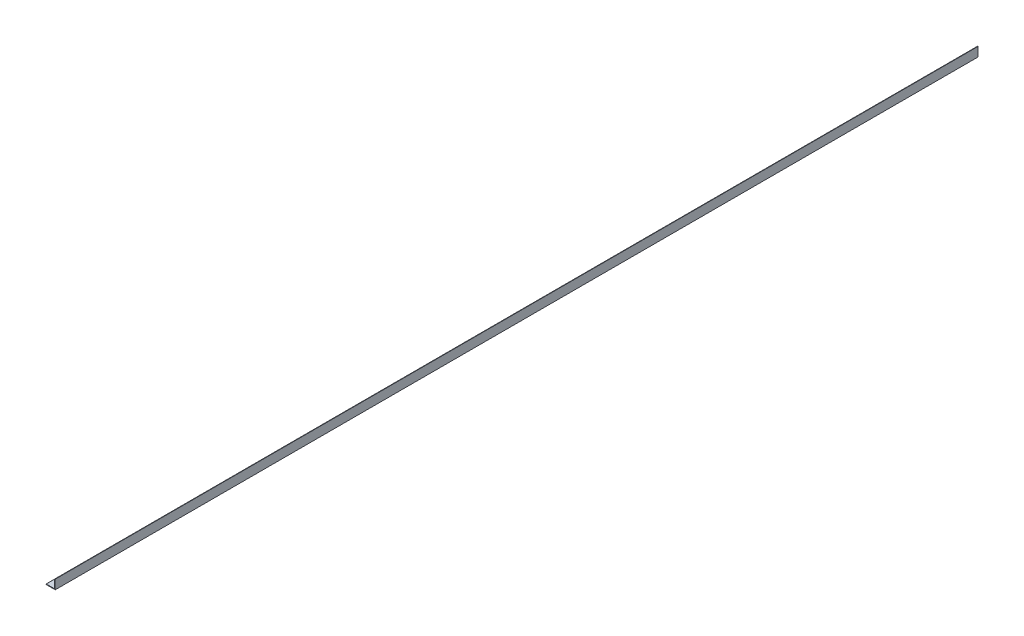
ISO-10303-21;
HEADER;
FILE_DESCRIPTION(('STEP AP214'),'2;1');
FILE_NAME('part.step','',(''),(''),'','','');
FILE_SCHEMA(('AUTOMOTIVE_DESIGN { 1 0 10303 214 1 1 1 1 }'));
ENDSEC;
DATA;
#1=APPLICATION_CONTEXT('core data for automotive mechanical design processes');
#2=APPLICATION_PROTOCOL_DEFINITION('international standard','automotive_design',2000,#1);
#3=PRODUCT_CONTEXT('',#1,'mechanical');
#4=PRODUCT('Part','Part','',(#3));
#5=PRODUCT_RELATED_PRODUCT_CATEGORY('part','',(#4));
#6=PRODUCT_DEFINITION_FORMATION('','',#4);
#7=PRODUCT_DEFINITION_CONTEXT('part definition',#1,'design');
#8=PRODUCT_DEFINITION('design','',#6,#7);
#9=PRODUCT_DEFINITION_SHAPE('','',#8);
#10=(LENGTH_UNIT() NAMED_UNIT(*) SI_UNIT(.MILLI.,.METRE.));
#11=(NAMED_UNIT(*) PLANE_ANGLE_UNIT() SI_UNIT($,.RADIAN.));
#12=(NAMED_UNIT(*) SI_UNIT($,.STERADIAN.) SOLID_ANGLE_UNIT());
#13=UNCERTAINTY_MEASURE_WITH_UNIT(LENGTH_MEASURE(1.E-05),#10,'distance_accuracy_value','');
#14=(GEOMETRIC_REPRESENTATION_CONTEXT(3) GLOBAL_UNCERTAINTY_ASSIGNED_CONTEXT((#13)) GLOBAL_UNIT_ASSIGNED_CONTEXT((#10,
#11,#12)) REPRESENTATION_CONTEXT('',''));
#15=CARTESIAN_POINT('',(0.,0.,0.));
#16=DIRECTION('',(0.,0.,1.));
#17=DIRECTION('',(1.,0.,0.));
#18=AXIS2_PLACEMENT_3D('',#15,#16,#17);
#19=CARTESIAN_POINT('',(9.5377,-11.1125,1270.));
#20=DIRECTION('',(0.,-1.,0.));
#21=DIRECTION('',(0.,0.,-1.));
#22=AXIS2_PLACEMENT_3D('',#19,#20,#21);
#23=PLANE('',#22);
#24=DIRECTION('',(0.,0.,1.));
#25=VECTOR('',#24,1.);
#26=CARTESIAN_POINT('',(-4.6355,-11.1125,1057.275));
#27=LINE('',#26,#25);
#28=CARTESIAN_POINT('',(-4.6355,-11.1125,1057.275));
#29=VERTEX_POINT('',#28);
#30=CARTESIAN_POINT('',(-4.63549999999999,-11.1125,1076.325));
#31=VERTEX_POINT('',#30);
#32=EDGE_CURVE('E249',#29,#31,#27,.T.);
#33=ORIENTED_EDGE('',*,*,#32,.F.);
#34=CARTESIAN_POINT('',(-1.5875,-11.1125,1057.275));
#35=DIRECTION('',(0.,1.,0.));
#36=DIRECTION('',(0.,0.,1.));
#37=AXIS2_PLACEMENT_3D('',#34,#35,#36);
#38=CIRCLE('',#37,3.048);
#39=CARTESIAN_POINT('',(1.4605,-11.1125,1057.275));
#40=VERTEX_POINT('',#39);
#41=EDGE_CURVE('E60',#40,#29,#38,.T.);
#42=ORIENTED_EDGE('',*,*,#41,.F.);
#43=DIRECTION('',(0.,0.,-1.));
#44=VECTOR('',#43,1.);
#45=CARTESIAN_POINT('',(1.4605,-11.1125,1057.275));
#46=LINE('',#45,#44);
#47=CARTESIAN_POINT('',(1.4605,-11.1125,1076.325));
#48=VERTEX_POINT('',#47);
#49=EDGE_CURVE('E236',#48,#40,#46,.T.);
#50=ORIENTED_EDGE('',*,*,#49,.F.);
#51=CARTESIAN_POINT('',(-1.58749999999999,-11.1125,1076.325));
#52=DIRECTION('',(0.,1.,0.));
#53=DIRECTION('',(0.,0.,1.));
#54=AXIS2_PLACEMENT_3D('',#51,#52,#53);
#55=CIRCLE('',#54,3.048);
#56=EDGE_CURVE('E240',#31,#48,#55,.T.);
#57=ORIENTED_EDGE('',*,*,#56,.F.);
#58=EDGE_LOOP('',(#33,#42,#50,#57));
#59=FACE_BOUND('',#58,.T.);
#60=DIRECTION('',(0.,0.,1.));
#61=VECTOR('',#60,1.);
#62=CARTESIAN_POINT('',(-4.63550000000005,-11.1125,641.35));
#63=LINE('',#62,#61);
#64=CARTESIAN_POINT('',(-4.63550000000005,-11.1125,641.35));
#65=VERTEX_POINT('',#64);
#66=CARTESIAN_POINT('',(-4.63550000000004,-11.1125,660.4));
#67=VERTEX_POINT('',#66);
#68=EDGE_CURVE('E285',#65,#67,#63,.T.);
#69=ORIENTED_EDGE('',*,*,#68,.F.);
#70=CARTESIAN_POINT('',(-1.58750000000005,-11.1125,641.35));
#71=DIRECTION('',(0.,1.,0.));
#72=DIRECTION('',(0.,0.,1.));
#73=AXIS2_PLACEMENT_3D('',#70,#71,#72);
#74=CIRCLE('',#73,3.048);
#75=CARTESIAN_POINT('',(1.46049999999995,-11.1125,641.35));
#76=VERTEX_POINT('',#75);
#77=EDGE_CURVE('E68',#76,#65,#74,.T.);
#78=ORIENTED_EDGE('',*,*,#77,.F.);
#79=DIRECTION('',(0.,0.,-1.));
#80=VECTOR('',#79,1.);
#81=CARTESIAN_POINT('',(1.46049999999995,-11.1125,641.35));
#82=LINE('',#81,#80);
#83=CARTESIAN_POINT('',(1.46049999999996,-11.1125,660.4));
#84=VERTEX_POINT('',#83);
#85=EDGE_CURVE('E270',#84,#76,#82,.T.);
#86=ORIENTED_EDGE('',*,*,#85,.F.);
#87=CARTESIAN_POINT('',(-1.58750000000004,-11.1125,660.4));
#88=DIRECTION('',(0.,1.,0.));
#89=DIRECTION('',(0.,0.,1.));
#90=AXIS2_PLACEMENT_3D('',#87,#88,#89);
#91=CIRCLE('',#90,3.048);
#92=EDGE_CURVE('E290',#67,#84,#91,.T.);
#93=ORIENTED_EDGE('',*,*,#92,.F.);
#94=EDGE_LOOP('',(#69,#78,#86,#93));
#95=FACE_BOUND('',#94,.T.);
#96=DIRECTION('',(0.,0.,-1.));
#97=VECTOR('',#96,1.);
#98=CARTESIAN_POINT('',(1.46049999999992,-11.1125,-317.5));
#99=LINE('',#98,#97);
#100=CARTESIAN_POINT('',(1.46049999999992,-11.1125,-317.5));
#101=VERTEX_POINT('',#100);
#102=CARTESIAN_POINT('',(1.46049999999992,-11.1125,-336.55));
#103=VERTEX_POINT('',#102);
#104=EDGE_CURVE('E328',#101,#103,#99,.T.);
#105=ORIENTED_EDGE('',*,*,#104,.F.);
#106=CARTESIAN_POINT('',(-1.58750000000008,-11.1125,-317.5));
#107=DIRECTION('',(0.,1.,0.));
#108=DIRECTION('',(0.,0.,-1.));
#109=AXIS2_PLACEMENT_3D('',#106,#107,#108);
#110=CIRCLE('',#109,3.048);
#111=CARTESIAN_POINT('',(-4.63550000000008,-11.1125,-317.5));
#112=VERTEX_POINT('',#111);
#113=EDGE_CURVE('E325',#112,#101,#110,.T.);
#114=ORIENTED_EDGE('',*,*,#113,.F.);
#115=DIRECTION('',(0.,0.,1.));
#116=VECTOR('',#115,1.);
#117=CARTESIAN_POINT('',(-4.63550000000008,-11.1125,-317.5));
#118=LINE('',#117,#116);
#119=CARTESIAN_POINT('',(-4.63550000000008,-11.1125,-336.55));
#120=VERTEX_POINT('',#119);
#121=EDGE_CURVE('E312',#120,#112,#118,.T.);
#122=ORIENTED_EDGE('',*,*,#121,.F.);
#123=CARTESIAN_POINT('',(-1.58750000000008,-11.1125,-336.55));
#124=DIRECTION('',(0.,1.,0.));
#125=DIRECTION('',(0.,0.,-1.));
#126=AXIS2_PLACEMENT_3D('',#123,#124,#125);
#127=CIRCLE('',#126,3.048);
#128=EDGE_CURVE('E333',#103,#120,#127,.T.);
#129=ORIENTED_EDGE('',*,*,#128,.F.);
#130=EDGE_LOOP('',(#105,#114,#122,#129));
#131=FACE_BOUND('',#130,.T.);
#132=DIRECTION('',(0.,0.,-1.));
#133=VECTOR('',#132,1.);
#134=CARTESIAN_POINT('',(1.46049999999998,-11.1125,-717.55));
#135=LINE('',#134,#133);
#136=CARTESIAN_POINT('',(1.46049999999998,-11.1125,-717.55));
#137=VERTEX_POINT('',#136);
#138=CARTESIAN_POINT('',(1.46049999999999,-11.1125,-1092.2));
#139=VERTEX_POINT('',#138);
#140=EDGE_CURVE('E372',#137,#139,#135,.T.);
#141=ORIENTED_EDGE('',*,*,#140,.F.);
#142=CARTESIAN_POINT('',(-1.58750000000002,-11.1125,-717.55));
#143=DIRECTION('',(0.,1.,0.));
#144=DIRECTION('',(0.,0.,-1.));
#145=AXIS2_PLACEMENT_3D('',#142,#143,#144);
#146=CIRCLE('',#145,3.048);
#147=CARTESIAN_POINT('',(-4.63550000000002,-11.1125,-717.55));
#148=VERTEX_POINT('',#147);
#149=EDGE_CURVE('E369',#148,#137,#146,.T.);
#150=ORIENTED_EDGE('',*,*,#149,.F.);
#151=DIRECTION('',(0.,0.,1.));
#152=VECTOR('',#151,1.);
#153=CARTESIAN_POINT('',(-4.63550000000002,-11.1125,-717.55));
#154=LINE('',#153,#152);
#155=CARTESIAN_POINT('',(-4.63550000000001,-11.1125,-1092.2));
#156=VERTEX_POINT('',#155);
#157=EDGE_CURVE('E356',#156,#148,#154,.T.);
#158=ORIENTED_EDGE('',*,*,#157,.F.);
#159=CARTESIAN_POINT('',(-1.58750000000001,-11.1125,-1092.2));
#160=DIRECTION('',(0.,1.,0.));
#161=DIRECTION('',(0.,0.,-1.));
#162=AXIS2_PLACEMENT_3D('',#159,#160,#161);
#163=CIRCLE('',#162,3.048);
#164=EDGE_CURVE('E376',#139,#156,#163,.T.);
#165=ORIENTED_EDGE('',*,*,#164,.F.);
#166=EDGE_LOOP('',(#141,#150,#158,#165));
#167=FACE_BOUND('',#166,.T.);
#168=CARTESIAN_POINT('',(-1.5875,-11.1125,1017.524));
#169=DIRECTION('',(0.,1.,0.));
#170=DIRECTION('',(0.,0.,1.));
#171=AXIS2_PLACEMENT_3D('',#168,#169,#170);
#172=CIRCLE('',#171,2.55269999999999);
#173=CARTESIAN_POINT('',(-1.5875,-11.1125,1020.0767));
#174=VERTEX_POINT('',#173);
#175=EDGE_CURVE('E259',#174,#174,#172,.T.);
#176=ORIENTED_EDGE('',*,*,#175,.F.);
#177=EDGE_LOOP('',(#176));
#178=FACE_BOUND('',#177,.T.);
#179=CARTESIAN_POINT('',(-1.5875,-11.1125,-349.504));
#180=DIRECTION('',(0.,1.,0.));
#181=DIRECTION('',(0.,0.,1.));
#182=AXIS2_PLACEMENT_3D('',#179,#180,#181);
#183=CIRCLE('',#182,2.55269999999999);
#184=CARTESIAN_POINT('',(-1.5875,-11.1125,-346.9513));
#185=VERTEX_POINT('',#184);
#186=EDGE_CURVE('E409',#185,#185,#183,.T.);
#187=ORIENTED_EDGE('',*,*,#186,.F.);
#188=EDGE_LOOP('',(#187));
#189=FACE_BOUND('',#188,.T.);
#190=CARTESIAN_POINT('',(-1.5875,-11.1125,106.172));
#191=DIRECTION('',(0.,1.,0.));
#192=DIRECTION('',(0.,0.,1.));
#193=AXIS2_PLACEMENT_3D('',#190,#191,#192);
#194=CIRCLE('',#193,2.55269999999999);
#195=CARTESIAN_POINT('',(-1.5875,-11.1125,108.7247));
#196=VERTEX_POINT('',#195);
#197=EDGE_CURVE('E417',#196,#196,#194,.T.);
#198=ORIENTED_EDGE('',*,*,#197,.F.);
#199=EDGE_LOOP('',(#198));
#200=FACE_BOUND('',#199,.T.);
#201=DIRECTION('',(-1.,0.,0.));
#202=VECTOR('',#201,1.);
#203=CARTESIAN_POINT('',(9.5377,-11.1125,-1270.));
#204=LINE('',#203,#202);
#205=CARTESIAN_POINT('',(9.5377,-11.1125,-1270.));
#206=VERTEX_POINT('',#205);
#207=CARTESIAN_POINT('',(-11.90625,-11.1125,-1270.));
#208=VERTEX_POINT('',#207);
#209=EDGE_CURVE('E477',#206,#208,#204,.T.);
#210=ORIENTED_EDGE('',*,*,#209,.T.);
#211=DIRECTION('',(0.,0.,-1.));
#212=VECTOR('',#211,1.);
#213=CARTESIAN_POINT('',(-11.90625,-11.1125,1270.));
#214=LINE('',#213,#212);
#215=CARTESIAN_POINT('',(-11.90625,-11.1125,1270.));
#216=VERTEX_POINT('',#215);
#217=EDGE_CURVE('E485',#216,#208,#214,.T.);
#218=ORIENTED_EDGE('',*,*,#217,.F.);
#219=DIRECTION('',(-1.,0.,0.));
#220=VECTOR('',#219,1.);
#221=CARTESIAN_POINT('',(9.5377,-11.1125,1270.));
#222=LINE('',#221,#220);
#223=CARTESIAN_POINT('',(9.5377,-11.1125,1270.));
#224=VERTEX_POINT('',#223);
#225=EDGE_CURVE('E449',#224,#216,#222,.T.);
#226=ORIENTED_EDGE('',*,*,#225,.F.);
#227=DIRECTION('',(0.,0.,-1.));
#228=VECTOR('',#227,1.);
#229=CARTESIAN_POINT('',(9.5377,-11.1125,1270.));
#230=LINE('',#229,#228);
#231=EDGE_CURVE('E489',#224,#206,#230,.T.);
#232=ORIENTED_EDGE('',*,*,#231,.T.);
#233=EDGE_LOOP('',(#210,#218,#226,#232));
#234=FACE_BOUND('',#233,.T.);
#235=CARTESIAN_POINT('',(-1.5875,-11.1125,561.848));
#236=DIRECTION('',(0.,1.,0.));
#237=DIRECTION('',(0.,0.,1.));
#238=AXIS2_PLACEMENT_3D('',#235,#236,#237);
#239=CIRCLE('',#238,2.55269999999999);
#240=CARTESIAN_POINT('',(-1.5875,-11.1125,564.4007));
#241=VERTEX_POINT('',#240);
#242=EDGE_CURVE('E401',#241,#241,#239,.T.);
#243=ORIENTED_EDGE('',*,*,#242,.F.);
#244=EDGE_LOOP('',(#243));
#245=FACE_BOUND('',#244,.T.);
#246=ADVANCED_FACE('F44',(#59,#95,#131,#167,#178,#189,#200,#234,#245),#23,.F.);
#247=CARTESIAN_POINT('',(-12.7,-11.90625,1270.));
#248=DIRECTION('',(1.,0.,0.));
#249=DIRECTION('',(0.,0.,-1.));
#250=AXIS2_PLACEMENT_3D('',#247,#248,#249);
#251=PLANE('',#250);
#252=DIRECTION('',(0.,-1.,0.));
#253=VECTOR('',#252,1.);
#254=CARTESIAN_POINT('',(-12.7,-11.90625,-1270.));
#255=LINE('',#254,#253);
#256=CARTESIAN_POINT('',(-12.7,-11.90625,-1270.));
#257=VERTEX_POINT('',#256);
#258=CARTESIAN_POINT('',(-12.7,-12.7,-1270.));
#259=VERTEX_POINT('',#258);
#260=EDGE_CURVE('E425',#257,#259,#255,.T.);
#261=ORIENTED_EDGE('',*,*,#260,.T.);
#262=DIRECTION('',(0.,0.,-1.));
#263=VECTOR('',#262,1.);
#264=CARTESIAN_POINT('',(-12.7,-12.7,1270.));
#265=LINE('',#264,#263);
#266=CARTESIAN_POINT('',(-12.7,-12.7,1270.));
#267=VERTEX_POINT('',#266);
#268=EDGE_CURVE('E11',#267,#259,#265,.T.);
#269=ORIENTED_EDGE('',*,*,#268,.F.);
#270=DIRECTION('',(0.,-1.,0.));
#271=VECTOR('',#270,1.);
#272=CARTESIAN_POINT('',(-12.7,-11.90625,1270.));
#273=LINE('',#272,#271);
#274=CARTESIAN_POINT('',(-12.7,-11.90625,1270.));
#275=VERTEX_POINT('',#274);
#276=EDGE_CURVE('E426',#275,#267,#273,.T.);
#277=ORIENTED_EDGE('',*,*,#276,.F.);
#278=DIRECTION('',(0.,0.,-1.));
#279=VECTOR('',#278,1.);
#280=CARTESIAN_POINT('',(-12.7,-11.90625,1270.));
#281=LINE('',#280,#279);
#282=EDGE_CURVE('E455',#275,#257,#281,.T.);
#283=ORIENTED_EDGE('',*,*,#282,.T.);
#284=EDGE_LOOP('',(#261,#269,#277,#283));
#285=FACE_BOUND('',#284,.T.);
#286=ADVANCED_FACE('F46',(#285),#251,.F.);
#287=CARTESIAN_POINT('',(-12.7,-12.7,1270.));
#288=DIRECTION('',(0.,1.,0.));
#289=DIRECTION('',(-1.,0.,0.));
#290=AXIS2_PLACEMENT_3D('',#287,#288,#289);
#291=PLANE('',#290);
#292=DIRECTION('',(0.,0.,-1.));
#293=VECTOR('',#292,1.);
#294=CARTESIAN_POINT('',(1.4605,-12.7,1057.275));
#295=LINE('',#294,#293);
#296=CARTESIAN_POINT('',(1.4605,-12.7,1076.325));
#297=VERTEX_POINT('',#296);
#298=CARTESIAN_POINT('',(1.4605,-12.7,1057.275));
#299=VERTEX_POINT('',#298);
#300=EDGE_CURVE('E221',#297,#299,#295,.T.);
#301=ORIENTED_EDGE('',*,*,#300,.T.);
#302=CARTESIAN_POINT('',(-1.5875,-12.7,1057.275));
#303=DIRECTION('',(0.,1.,0.));
#304=DIRECTION('',(0.,0.,1.));
#305=AXIS2_PLACEMENT_3D('',#302,#303,#304);
#306=CIRCLE('',#305,3.048);
#307=CARTESIAN_POINT('',(-4.6355,-12.7,1057.275));
#308=VERTEX_POINT('',#307);
#309=EDGE_CURVE('E214',#299,#308,#306,.T.);
#310=ORIENTED_EDGE('',*,*,#309,.T.);
#311=DIRECTION('',(0.,0.,1.));
#312=VECTOR('',#311,1.);
#313=CARTESIAN_POINT('',(-4.6355,-12.7,1057.275));
#314=LINE('',#313,#312);
#315=CARTESIAN_POINT('',(-4.63549999999999,-12.7,1076.325));
#316=VERTEX_POINT('',#315);
#317=EDGE_CURVE('E225',#308,#316,#314,.T.);
#318=ORIENTED_EDGE('',*,*,#317,.T.);
#319=CARTESIAN_POINT('',(-1.58749999999999,-12.7,1076.325));
#320=DIRECTION('',(0.,1.,0.));
#321=DIRECTION('',(0.,0.,1.));
#322=AXIS2_PLACEMENT_3D('',#319,#320,#321);
#323=CIRCLE('',#322,3.048);
#324=EDGE_CURVE('E230',#316,#297,#323,.T.);
#325=ORIENTED_EDGE('',*,*,#324,.T.);
#326=EDGE_LOOP('',(#301,#310,#318,#325));
#327=FACE_BOUND('',#326,.T.);
#328=DIRECTION('',(0.,0.,-1.));
#329=VECTOR('',#328,1.);
#330=CARTESIAN_POINT('',(1.46049999999995,-12.7,641.35));
#331=LINE('',#330,#329);
#332=CARTESIAN_POINT('',(1.46049999999996,-12.7,660.4));
#333=VERTEX_POINT('',#332);
#334=CARTESIAN_POINT('',(1.46049999999995,-12.7,641.35));
#335=VERTEX_POINT('',#334);
#336=EDGE_CURVE('E278',#333,#335,#331,.T.);
#337=ORIENTED_EDGE('',*,*,#336,.T.);
#338=CARTESIAN_POINT('',(-1.58750000000005,-12.7,641.35));
#339=DIRECTION('',(0.,1.,0.));
#340=DIRECTION('',(0.,0.,1.));
#341=AXIS2_PLACEMENT_3D('',#338,#339,#340);
#342=CIRCLE('',#341,3.048);
#343=CARTESIAN_POINT('',(-4.63550000000005,-12.7,641.35));
#344=VERTEX_POINT('',#343);
#345=EDGE_CURVE('E265',#335,#344,#342,.T.);
#346=ORIENTED_EDGE('',*,*,#345,.T.);
#347=DIRECTION('',(0.,0.,1.));
#348=VECTOR('',#347,1.);
#349=CARTESIAN_POINT('',(-4.63550000000005,-12.7,641.35));
#350=LINE('',#349,#348);
#351=CARTESIAN_POINT('',(-4.63550000000004,-12.7,660.4));
#352=VERTEX_POINT('',#351);
#353=EDGE_CURVE('E269',#344,#352,#350,.T.);
#354=ORIENTED_EDGE('',*,*,#353,.T.);
#355=CARTESIAN_POINT('',(-1.58750000000004,-12.7,660.4));
#356=DIRECTION('',(0.,1.,0.));
#357=DIRECTION('',(0.,0.,1.));
#358=AXIS2_PLACEMENT_3D('',#355,#356,#357);
#359=CIRCLE('',#358,3.048);
#360=EDGE_CURVE('E274',#352,#333,#359,.T.);
#361=ORIENTED_EDGE('',*,*,#360,.T.);
#362=EDGE_LOOP('',(#337,#346,#354,#361));
#363=FACE_BOUND('',#362,.T.);
#364=DIRECTION('',(0.,0.,1.));
#365=VECTOR('',#364,1.);
#366=CARTESIAN_POINT('',(-4.63550000000008,-12.7,-317.5));
#367=LINE('',#366,#365);
#368=CARTESIAN_POINT('',(-4.63550000000008,-12.7,-336.55));
#369=VERTEX_POINT('',#368);
#370=CARTESIAN_POINT('',(-4.63550000000008,-12.7,-317.5));
#371=VERTEX_POINT('',#370);
#372=EDGE_CURVE('E320',#369,#371,#367,.T.);
#373=ORIENTED_EDGE('',*,*,#372,.T.);
#374=CARTESIAN_POINT('',(-1.58750000000008,-12.7,-317.5));
#375=DIRECTION('',(0.,1.,0.));
#376=DIRECTION('',(0.,0.,-1.));
#377=AXIS2_PLACEMENT_3D('',#374,#375,#376);
#378=CIRCLE('',#377,3.048);
#379=CARTESIAN_POINT('',(1.46049999999992,-12.7,-317.5));
#380=VERTEX_POINT('',#379);
#381=EDGE_CURVE('E307',#371,#380,#378,.T.);
#382=ORIENTED_EDGE('',*,*,#381,.T.);
#383=DIRECTION('',(0.,0.,-1.));
#384=VECTOR('',#383,1.);
#385=CARTESIAN_POINT('',(1.46049999999992,-12.7,-317.5));
#386=LINE('',#385,#384);
#387=CARTESIAN_POINT('',(1.46049999999992,-12.7,-336.55));
#388=VERTEX_POINT('',#387);
#389=EDGE_CURVE('E311',#380,#388,#386,.T.);
#390=ORIENTED_EDGE('',*,*,#389,.T.);
#391=CARTESIAN_POINT('',(-1.58750000000008,-12.7,-336.55));
#392=DIRECTION('',(0.,1.,0.));
#393=DIRECTION('',(0.,0.,-1.));
#394=AXIS2_PLACEMENT_3D('',#391,#392,#393);
#395=CIRCLE('',#394,3.048);
#396=EDGE_CURVE('E316',#388,#369,#395,.T.);
#397=ORIENTED_EDGE('',*,*,#396,.T.);
#398=EDGE_LOOP('',(#373,#382,#390,#397));
#399=FACE_BOUND('',#398,.T.);
#400=DIRECTION('',(0.,0.,1.));
#401=VECTOR('',#400,1.);
#402=CARTESIAN_POINT('',(-4.63550000000002,-12.7,-717.55));
#403=LINE('',#402,#401);
#404=CARTESIAN_POINT('',(-4.63550000000001,-12.7,-1092.2));
#405=VERTEX_POINT('',#404);
#406=CARTESIAN_POINT('',(-4.63550000000002,-12.7,-717.55));
#407=VERTEX_POINT('',#406);
#408=EDGE_CURVE('E364',#405,#407,#403,.T.);
#409=ORIENTED_EDGE('',*,*,#408,.T.);
#410=CARTESIAN_POINT('',(-1.58750000000002,-12.7,-717.55));
#411=DIRECTION('',(0.,1.,0.));
#412=DIRECTION('',(0.,0.,-1.));
#413=AXIS2_PLACEMENT_3D('',#410,#411,#412);
#414=CIRCLE('',#413,3.048);
#415=CARTESIAN_POINT('',(1.46049999999998,-12.7,-717.55));
#416=VERTEX_POINT('',#415);
#417=EDGE_CURVE('E351',#407,#416,#414,.T.);
#418=ORIENTED_EDGE('',*,*,#417,.T.);
#419=DIRECTION('',(0.,0.,-1.));
#420=VECTOR('',#419,1.);
#421=CARTESIAN_POINT('',(1.46049999999998,-12.7,-717.55));
#422=LINE('',#421,#420);
#423=CARTESIAN_POINT('',(1.46049999999999,-12.7,-1092.2));
#424=VERTEX_POINT('',#423);
#425=EDGE_CURVE('E355',#416,#424,#422,.T.);
#426=ORIENTED_EDGE('',*,*,#425,.T.);
#427=CARTESIAN_POINT('',(-1.58750000000001,-12.7,-1092.2));
#428=DIRECTION('',(0.,1.,0.));
#429=DIRECTION('',(0.,0.,-1.));
#430=AXIS2_PLACEMENT_3D('',#427,#428,#429);
#431=CIRCLE('',#430,3.048);
#432=EDGE_CURVE('E360',#424,#405,#431,.T.);
#433=ORIENTED_EDGE('',*,*,#432,.T.);
#434=EDGE_LOOP('',(#409,#418,#426,#433));
#435=FACE_BOUND('',#434,.T.);
#436=CARTESIAN_POINT('',(-1.5875,-12.7,1017.524));
#437=DIRECTION('',(0.,1.,0.));
#438=DIRECTION('',(0.,0.,1.));
#439=AXIS2_PLACEMENT_3D('',#436,#437,#438);
#440=CIRCLE('',#439,2.5527);
#441=CARTESIAN_POINT('',(-1.5875,-12.7,1020.0767));
#442=VERTEX_POINT('',#441);
#443=EDGE_CURVE('E397',#442,#442,#440,.T.);
#444=ORIENTED_EDGE('',*,*,#443,.T.);
#445=EDGE_LOOP('',(#444));
#446=FACE_BOUND('',#445,.T.);
#447=CARTESIAN_POINT('',(-1.5875,-12.7,561.848));
#448=DIRECTION('',(0.,1.,0.));
#449=DIRECTION('',(0.,0.,1.));
#450=AXIS2_PLACEMENT_3D('',#447,#448,#449);
#451=CIRCLE('',#450,2.5527);
#452=CARTESIAN_POINT('',(-1.5875,-12.7,564.4007));
#453=VERTEX_POINT('',#452);
#454=EDGE_CURVE('E405',#453,#453,#451,.T.);
#455=ORIENTED_EDGE('',*,*,#454,.T.);
#456=EDGE_LOOP('',(#455));
#457=FACE_BOUND('',#456,.T.);
#458=CARTESIAN_POINT('',(-1.5875,-12.7,-349.504));
#459=DIRECTION('',(0.,1.,0.));
#460=DIRECTION('',(0.,0.,1.));
#461=AXIS2_PLACEMENT_3D('',#458,#459,#460);
#462=CIRCLE('',#461,2.5527);
#463=CARTESIAN_POINT('',(-1.5875,-12.7,-346.9513));
#464=VERTEX_POINT('',#463);
#465=EDGE_CURVE('E413',#464,#464,#462,.T.);
#466=ORIENTED_EDGE('',*,*,#465,.T.);
#467=EDGE_LOOP('',(#466));
#468=FACE_BOUND('',#467,.T.);
#469=CARTESIAN_POINT('',(-1.5875,-12.7,106.172));
#470=DIRECTION('',(0.,1.,0.));
#471=DIRECTION('',(0.,0.,1.));
#472=AXIS2_PLACEMENT_3D('',#469,#470,#471);
#473=CIRCLE('',#472,2.5527);
#474=CARTESIAN_POINT('',(-1.5875,-12.7,108.7247));
#475=VERTEX_POINT('',#474);
#476=EDGE_CURVE('E421',#475,#475,#473,.T.);
#477=ORIENTED_EDGE('',*,*,#476,.T.);
#478=EDGE_LOOP('',(#477));
#479=FACE_BOUND('',#478,.T.);
#480=DIRECTION('',(1.,0.,0.));
#481=VECTOR('',#480,1.);
#482=CARTESIAN_POINT('',(-12.7,-12.7,-1270.));
#483=LINE('',#482,#481);
#484=CARTESIAN_POINT('',(12.7,-12.7,-1270.));
#485=VERTEX_POINT('',#484);
#486=EDGE_CURVE('E459',#259,#485,#483,.T.);
#487=ORIENTED_EDGE('',*,*,#486,.T.);
#488=DIRECTION('',(0.,0.,-1.));
#489=VECTOR('',#488,1.);
#490=CARTESIAN_POINT('',(12.7,-12.7,1270.));
#491=LINE('',#490,#489);
#492=CARTESIAN_POINT('',(12.7,-12.7,1270.));
#493=VERTEX_POINT('',#492);
#494=EDGE_CURVE('E53',#493,#485,#491,.T.);
#495=ORIENTED_EDGE('',*,*,#494,.F.);
#496=DIRECTION('',(1.,0.,0.));
#497=VECTOR('',#496,1.);
#498=CARTESIAN_POINT('',(-12.7,-12.7,1270.));
#499=LINE('',#498,#497);
#500=EDGE_CURVE('E430',#267,#493,#499,.T.);
#501=ORIENTED_EDGE('',*,*,#500,.F.);
#502=ORIENTED_EDGE('',*,*,#268,.T.);
#503=EDGE_LOOP('',(#487,#495,#501,#502));
#504=FACE_BOUND('',#503,.T.);
#505=ADVANCED_FACE('F232',(#327,#363,#399,#435,#446,#457,#468,#479,#504),#291,.F.);
#506=CARTESIAN_POINT('',(12.7,-12.7,1270.));
#507=DIRECTION('',(-1.,0.,0.));
#508=DIRECTION('',(0.,-1.,0.));
#509=AXIS2_PLACEMENT_3D('',#506,#507,#508);
#510=PLANE('',#509);
#511=DIRECTION('',(0.,1.,0.));
#512=VECTOR('',#511,1.);
#513=CARTESIAN_POINT('',(12.7,-12.7,-1270.));
#514=LINE('',#513,#512);
#515=CARTESIAN_POINT('',(12.7,12.7,-1270.));
#516=VERTEX_POINT('',#515);
#517=EDGE_CURVE('E462',#485,#516,#514,.T.);
#518=ORIENTED_EDGE('',*,*,#517,.T.);
#519=DIRECTION('',(0.,0.,-1.));
#520=VECTOR('',#519,1.);
#521=CARTESIAN_POINT('',(12.7,12.7,1270.));
#522=LINE('',#521,#520);
#523=CARTESIAN_POINT('',(12.7,12.7,1270.));
#524=VERTEX_POINT('',#523);
#525=EDGE_CURVE('E505',#524,#516,#522,.T.);
#526=ORIENTED_EDGE('',*,*,#525,.F.);
#527=DIRECTION('',(0.,1.,0.));
#528=VECTOR('',#527,1.);
#529=CARTESIAN_POINT('',(12.7,-12.7,1270.));
#530=LINE('',#529,#528);
#531=EDGE_CURVE('E434',#493,#524,#530,.T.);
#532=ORIENTED_EDGE('',*,*,#531,.F.);
#533=ORIENTED_EDGE('',*,*,#494,.T.);
#534=EDGE_LOOP('',(#518,#526,#532,#533));
#535=FACE_BOUND('',#534,.T.);
#536=ADVANCED_FACE('F514',(#535),#510,.F.);
#537=CARTESIAN_POINT('',(11.90625,12.7,1270.));
#538=DIRECTION('',(0.,-1.,0.));
#539=DIRECTION('',(0.,0.,-1.));
#540=AXIS2_PLACEMENT_3D('',#537,#538,#539);
#541=PLANE('',#540);
#542=DIRECTION('',(-1.,0.,0.));
#543=VECTOR('',#542,1.);
#544=CARTESIAN_POINT('',(11.90625,12.7,-1270.));
#545=LINE('',#544,#543);
#546=CARTESIAN_POINT('',(11.90625,12.7,-1270.));
#547=VERTEX_POINT('',#546);
#548=EDGE_CURVE('E465',#516,#547,#545,.T.);
#549=ORIENTED_EDGE('',*,*,#548,.T.);
#550=DIRECTION('',(0.,0.,-1.));
#551=VECTOR('',#550,1.);
#552=CARTESIAN_POINT('',(11.90625,12.7,1270.));
#553=LINE('',#552,#551);
#554=CARTESIAN_POINT('',(11.90625,12.7,1270.));
#555=VERTEX_POINT('',#554);
#556=EDGE_CURVE('E501',#555,#547,#553,.T.);
#557=ORIENTED_EDGE('',*,*,#556,.F.);
#558=DIRECTION('',(-1.,0.,0.));
#559=VECTOR('',#558,1.);
#560=CARTESIAN_POINT('',(11.90625,12.7,1270.));
#561=LINE('',#560,#559);
#562=EDGE_CURVE('E437',#524,#555,#561,.T.);
#563=ORIENTED_EDGE('',*,*,#562,.F.);
#564=ORIENTED_EDGE('',*,*,#525,.T.);
#565=EDGE_LOOP('',(#549,#557,#563,#564));
#566=FACE_BOUND('',#565,.T.);
#567=ADVANCED_FACE('F525',(#566),#541,.F.);
#568=CARTESIAN_POINT('',(11.90625,11.90625,1270.));
#569=DIRECTION('',(0.,0.,-1.));
#570=DIRECTION('',(-1.,0.,0.));
#571=AXIS2_PLACEMENT_3D('',#568,#569,#570);
#572=CYLINDRICAL_SURFACE('',#571,0.793749999999998);
#573=CARTESIAN_POINT('',(11.90625,11.90625,-1270.));
#574=DIRECTION('',(0.,0.,1.));
#575=DIRECTION('',(-1.,0.,0.));
#576=AXIS2_PLACEMENT_3D('',#573,#574,#575);
#577=CIRCLE('',#576,0.793749999999998);
#578=CARTESIAN_POINT('',(11.1125,11.90625,-1270.));
#579=VERTEX_POINT('',#578);
#580=EDGE_CURVE('E468',#547,#579,#577,.T.);
#581=ORIENTED_EDGE('',*,*,#580,.T.);
#582=DIRECTION('',(0.,0.,-1.));
#583=VECTOR('',#582,1.);
#584=CARTESIAN_POINT('',(11.1125,11.90625,1270.));
#585=LINE('',#584,#583);
#586=CARTESIAN_POINT('',(11.1125,11.90625,1270.));
#587=VERTEX_POINT('',#586);
#588=EDGE_CURVE('E497',#587,#579,#585,.T.);
#589=ORIENTED_EDGE('',*,*,#588,.F.);
#590=CARTESIAN_POINT('',(11.90625,11.90625,1270.));
#591=DIRECTION('',(0.,0.,1.));
#592=DIRECTION('',(-1.,0.,0.));
#593=AXIS2_PLACEMENT_3D('',#590,#591,#592);
#594=CIRCLE('',#593,0.793749999999998);
#595=EDGE_CURVE('E440',#555,#587,#594,.T.);
#596=ORIENTED_EDGE('',*,*,#595,.F.);
#597=ORIENTED_EDGE('',*,*,#556,.T.);
#598=EDGE_LOOP('',(#581,#589,#596,#597));
#599=FACE_BOUND('',#598,.T.);
#600=ADVANCED_FACE('F529',(#599),#572,.T.);
#601=CARTESIAN_POINT('',(11.1125,11.90625,1270.));
#602=DIRECTION('',(1.,0.,0.));
#603=DIRECTION('',(0.,1.,0.));
#604=AXIS2_PLACEMENT_3D('',#601,#602,#603);
#605=PLANE('',#604);
#606=DIRECTION('',(0.,-1.,0.));
#607=VECTOR('',#606,1.);
#608=CARTESIAN_POINT('',(11.1125,11.90625,-1270.));
#609=LINE('',#608,#607);
#610=CARTESIAN_POINT('',(11.1125,-9.5377,-1270.));
#611=VERTEX_POINT('',#610);
#612=EDGE_CURVE('E471',#579,#611,#609,.T.);
#613=ORIENTED_EDGE('',*,*,#612,.T.);
#614=DIRECTION('',(0.,0.,-1.));
#615=VECTOR('',#614,1.);
#616=CARTESIAN_POINT('',(11.1125,-9.5377,1270.));
#617=LINE('',#616,#615);
#618=CARTESIAN_POINT('',(11.1125,-9.5377,1270.));
#619=VERTEX_POINT('',#618);
#620=EDGE_CURVE('E493',#619,#611,#617,.T.);
#621=ORIENTED_EDGE('',*,*,#620,.F.);
#622=DIRECTION('',(0.,-1.,0.));
#623=VECTOR('',#622,1.);
#624=CARTESIAN_POINT('',(11.1125,11.90625,1270.));
#625=LINE('',#624,#623);
#626=EDGE_CURVE('E443',#587,#619,#625,.T.);
#627=ORIENTED_EDGE('',*,*,#626,.F.);
#628=ORIENTED_EDGE('',*,*,#588,.T.);
#629=EDGE_LOOP('',(#613,#621,#627,#628));
#630=FACE_BOUND('',#629,.T.);
#631=ADVANCED_FACE('F554',(#630),#605,.F.);
#632=CARTESIAN_POINT('',(9.5377,-9.5377,1270.));
#633=DIRECTION('',(0.,0.,-1.));
#634=DIRECTION('',(-1.,0.,0.));
#635=AXIS2_PLACEMENT_3D('',#632,#633,#634);
#636=CYLINDRICAL_SURFACE('',#635,1.5748);
#637=CARTESIAN_POINT('',(9.5377,-9.5377,-1270.));
#638=DIRECTION('',(0.,0.,-1.));
#639=DIRECTION('',(-1.,0.,0.));
#640=AXIS2_PLACEMENT_3D('',#637,#638,#639);
#641=CIRCLE('',#640,1.5748);
#642=EDGE_CURVE('E474',#611,#206,#641,.T.);
#643=ORIENTED_EDGE('',*,*,#642,.T.);
#644=ORIENTED_EDGE('',*,*,#231,.F.);
#645=CARTESIAN_POINT('',(9.5377,-9.5377,1270.));
#646=DIRECTION('',(0.,0.,-1.));
#647=DIRECTION('',(-1.,0.,0.));
#648=AXIS2_PLACEMENT_3D('',#645,#646,#647);
#649=CIRCLE('',#648,1.5748);
#650=EDGE_CURVE('E446',#619,#224,#649,.T.);
#651=ORIENTED_EDGE('',*,*,#650,.F.);
#652=ORIENTED_EDGE('',*,*,#620,.T.);
#653=EDGE_LOOP('',(#643,#644,#651,#652));
#654=FACE_BOUND('',#653,.T.);
#655=ADVANCED_FACE('F552',(#654),#636,.F.);
#656=CARTESIAN_POINT('',(-11.90625,-11.90625,1270.));
#657=DIRECTION('',(0.,0.,-1.));
#658=DIRECTION('',(-1.,0.,0.));
#659=AXIS2_PLACEMENT_3D('',#656,#657,#658);
#660=CYLINDRICAL_SURFACE('',#659,0.79375);
#661=CARTESIAN_POINT('',(-11.90625,-11.90625,-1270.));
#662=DIRECTION('',(0.,0.,1.));
#663=DIRECTION('',(-1.,0.,0.));
#664=AXIS2_PLACEMENT_3D('',#661,#662,#663);
#665=CIRCLE('',#664,0.79375);
#666=EDGE_CURVE('E431',#208,#257,#665,.T.);
#667=ORIENTED_EDGE('',*,*,#666,.T.);
#668=ORIENTED_EDGE('',*,*,#282,.F.);
#669=CARTESIAN_POINT('',(-11.90625,-11.90625,1270.));
#670=DIRECTION('',(0.,0.,1.));
#671=DIRECTION('',(-1.,0.,0.));
#672=AXIS2_PLACEMENT_3D('',#669,#670,#671);
#673=CIRCLE('',#672,0.79375);
#674=EDGE_CURVE('E452',#216,#275,#673,.T.);
#675=ORIENTED_EDGE('',*,*,#674,.F.);
#676=ORIENTED_EDGE('',*,*,#217,.T.);
#677=EDGE_LOOP('',(#667,#668,#675,#676));
#678=FACE_BOUND('',#677,.T.);
#679=ADVANCED_FACE('F543',(#678),#660,.T.);
#680=CARTESIAN_POINT('',(11.90625,11.90625,1270.));
#681=DIRECTION('',(0.,0.,-1.));
#682=DIRECTION('',(-1.,0.,0.));
#683=AXIS2_PLACEMENT_3D('',#680,#681,#682);
#684=PLANE('',#683);
#685=ORIENTED_EDGE('',*,*,#276,.T.);
#686=ORIENTED_EDGE('',*,*,#500,.T.);
#687=ORIENTED_EDGE('',*,*,#531,.T.);
#688=ORIENTED_EDGE('',*,*,#562,.T.);
#689=ORIENTED_EDGE('',*,*,#595,.T.);
#690=ORIENTED_EDGE('',*,*,#626,.T.);
#691=ORIENTED_EDGE('',*,*,#650,.T.);
#692=ORIENTED_EDGE('',*,*,#225,.T.);
#693=ORIENTED_EDGE('',*,*,#674,.T.);
#694=EDGE_LOOP('',(#685,#686,#687,#688,#689,#690,#691,#692,#693));
#695=FACE_BOUND('',#694,.T.);
#696=ADVANCED_FACE('F533',(#695),#684,.F.);
#697=CARTESIAN_POINT('',(11.90625,11.90625,-1270.));
#698=DIRECTION('',(0.,0.,-1.));
#699=DIRECTION('',(-1.,0.,0.));
#700=AXIS2_PLACEMENT_3D('',#697,#698,#699);
#701=PLANE('',#700);
#702=ORIENTED_EDGE('',*,*,#260,.F.);
#703=ORIENTED_EDGE('',*,*,#666,.F.);
#704=ORIENTED_EDGE('',*,*,#209,.F.);
#705=ORIENTED_EDGE('',*,*,#642,.F.);
#706=ORIENTED_EDGE('',*,*,#612,.F.);
#707=ORIENTED_EDGE('',*,*,#580,.F.);
#708=ORIENTED_EDGE('',*,*,#548,.F.);
#709=ORIENTED_EDGE('',*,*,#517,.F.);
#710=ORIENTED_EDGE('',*,*,#486,.F.);
#711=EDGE_LOOP('',(#702,#703,#704,#705,#706,#707,#708,#709,#710));
#712=FACE_BOUND('',#711,.T.);
#713=ADVANCED_FACE('F520',(#712),#701,.T.);
#714=CARTESIAN_POINT('',(-1.5875,-11.1125,106.172));
#715=DIRECTION('',(0.,1.,0.));
#716=DIRECTION('',(0.,0.,1.));
#717=AXIS2_PLACEMENT_3D('',#714,#715,#716);
#718=CYLINDRICAL_SURFACE('',#717,2.55269999999999);
#719=ORIENTED_EDGE('',*,*,#476,.F.);
#720=EDGE_LOOP('',(#719));
#721=FACE_BOUND('',#720,.T.);
#722=ORIENTED_EDGE('',*,*,#197,.T.);
#723=EDGE_LOOP('',(#722));
#724=FACE_BOUND('',#723,.T.);
#725=ADVANCED_FACE('F575',(#721,#724),#718,.F.);
#726=CARTESIAN_POINT('',(-1.5875,-11.1125,-349.504));
#727=DIRECTION('',(0.,1.,0.));
#728=DIRECTION('',(0.,0.,1.));
#729=AXIS2_PLACEMENT_3D('',#726,#727,#728);
#730=CYLINDRICAL_SURFACE('',#729,2.55269999999999);
#731=ORIENTED_EDGE('',*,*,#465,.F.);
#732=EDGE_LOOP('',(#731));
#733=FACE_BOUND('',#732,.T.);
#734=ORIENTED_EDGE('',*,*,#186,.T.);
#735=EDGE_LOOP('',(#734));
#736=FACE_BOUND('',#735,.T.);
#737=ADVANCED_FACE('F580',(#733,#736),#730,.F.);
#738=CARTESIAN_POINT('',(-1.5875,-11.1125,561.848));
#739=DIRECTION('',(0.,1.,0.));
#740=DIRECTION('',(0.,0.,1.));
#741=AXIS2_PLACEMENT_3D('',#738,#739,#740);
#742=CYLINDRICAL_SURFACE('',#741,2.55269999999999);
#743=ORIENTED_EDGE('',*,*,#454,.F.);
#744=EDGE_LOOP('',(#743));
#745=FACE_BOUND('',#744,.T.);
#746=ORIENTED_EDGE('',*,*,#242,.T.);
#747=EDGE_LOOP('',(#746));
#748=FACE_BOUND('',#747,.T.);
#749=ADVANCED_FACE('F584',(#745,#748),#742,.F.);
#750=CARTESIAN_POINT('',(-1.5875,-11.1125,1017.524));
#751=DIRECTION('',(0.,1.,0.));
#752=DIRECTION('',(0.,0.,1.));
#753=AXIS2_PLACEMENT_3D('',#750,#751,#752);
#754=CYLINDRICAL_SURFACE('',#753,2.55269999999999);
#755=ORIENTED_EDGE('',*,*,#443,.F.);
#756=EDGE_LOOP('',(#755));
#757=FACE_BOUND('',#756,.T.);
#758=ORIENTED_EDGE('',*,*,#175,.T.);
#759=EDGE_LOOP('',(#758));
#760=FACE_BOUND('',#759,.T.);
#761=ADVANCED_FACE('F588',(#757,#760),#754,.F.);
#762=CARTESIAN_POINT('',(-1.58750000000002,-12.7,-717.55));
#763=DIRECTION('',(0.,1.,0.));
#764=DIRECTION('',(0.,0.,1.));
#765=AXIS2_PLACEMENT_3D('',#762,#763,#764);
#766=CYLINDRICAL_SURFACE('',#765,3.048);
#767=ORIENTED_EDGE('',*,*,#149,.T.);
#768=DIRECTION('',(0.,1.,0.));
#769=VECTOR('',#768,1.);
#770=CARTESIAN_POINT('',(1.46049999999998,-12.7,-717.55));
#771=LINE('',#770,#769);
#772=EDGE_CURVE('E368',#416,#137,#771,.T.);
#773=ORIENTED_EDGE('',*,*,#772,.F.);
#774=ORIENTED_EDGE('',*,*,#417,.F.);
#775=DIRECTION('',(0.,1.,0.));
#776=VECTOR('',#775,1.);
#777=CARTESIAN_POINT('',(-4.63550000000002,-12.7,-717.55));
#778=LINE('',#777,#776);
#779=EDGE_CURVE('E329',#407,#148,#778,.T.);
#780=ORIENTED_EDGE('',*,*,#779,.T.);
#781=EDGE_LOOP('',(#767,#773,#774,#780));
#782=FACE_BOUND('',#781,.T.);
#783=ADVANCED_FACE('F592',(#782),#766,.F.);
#784=CARTESIAN_POINT('',(-4.63550000000002,-12.7,-717.55));
#785=DIRECTION('',(-1.,0.,0.));
#786=DIRECTION('',(0.,0.,1.));
#787=AXIS2_PLACEMENT_3D('',#784,#785,#786);
#788=PLANE('',#787);
#789=ORIENTED_EDGE('',*,*,#157,.T.);
#790=ORIENTED_EDGE('',*,*,#779,.F.);
#791=ORIENTED_EDGE('',*,*,#408,.F.);
#792=DIRECTION('',(0.,1.,0.));
#793=VECTOR('',#792,1.);
#794=CARTESIAN_POINT('',(-4.63550000000001,-12.7,-1092.2));
#795=LINE('',#794,#793);
#796=EDGE_CURVE('E385',#405,#156,#795,.T.);
#797=ORIENTED_EDGE('',*,*,#796,.T.);
#798=EDGE_LOOP('',(#789,#790,#791,#797));
#799=FACE_BOUND('',#798,.T.);
#800=ADVANCED_FACE('F596',(#799),#788,.F.);
#801=CARTESIAN_POINT('',(-1.58750000000001,-12.7,-1092.2));
#802=DIRECTION('',(0.,1.,0.));
#803=DIRECTION('',(0.,0.,1.));
#804=AXIS2_PLACEMENT_3D('',#801,#802,#803);
#805=CYLINDRICAL_SURFACE('',#804,3.048);
#806=ORIENTED_EDGE('',*,*,#164,.T.);
#807=ORIENTED_EDGE('',*,*,#796,.F.);
#808=ORIENTED_EDGE('',*,*,#432,.F.);
#809=DIRECTION('',(0.,1.,0.));
#810=VECTOR('',#809,1.);
#811=CARTESIAN_POINT('',(1.46049999999999,-12.7,-1092.2));
#812=LINE('',#811,#810);
#813=EDGE_CURVE('E388',#424,#139,#812,.T.);
#814=ORIENTED_EDGE('',*,*,#813,.T.);
#815=EDGE_LOOP('',(#806,#807,#808,#814));
#816=FACE_BOUND('',#815,.T.);
#817=ADVANCED_FACE('F602',(#816),#805,.F.);
#818=CARTESIAN_POINT('',(1.46049999999998,-12.7,-717.55));
#819=DIRECTION('',(1.,0.,0.));
#820=DIRECTION('',(0.,0.,-1.));
#821=AXIS2_PLACEMENT_3D('',#818,#819,#820);
#822=PLANE('',#821);
#823=ORIENTED_EDGE('',*,*,#140,.T.);
#824=ORIENTED_EDGE('',*,*,#813,.F.);
#825=ORIENTED_EDGE('',*,*,#425,.F.);
#826=ORIENTED_EDGE('',*,*,#772,.T.);
#827=EDGE_LOOP('',(#823,#824,#825,#826));
#828=FACE_BOUND('',#827,.T.);
#829=ADVANCED_FACE('F598',(#828),#822,.F.);
#830=CARTESIAN_POINT('',(-1.58750000000008,-12.7,-317.5));
#831=DIRECTION('',(0.,1.,0.));
#832=DIRECTION('',(0.,0.,1.));
#833=AXIS2_PLACEMENT_3D('',#830,#831,#832);
#834=CYLINDRICAL_SURFACE('',#833,3.048);
#835=ORIENTED_EDGE('',*,*,#113,.T.);
#836=DIRECTION('',(0.,1.,0.));
#837=VECTOR('',#836,1.);
#838=CARTESIAN_POINT('',(1.46049999999992,-12.7,-317.5));
#839=LINE('',#838,#837);
#840=EDGE_CURVE('E324',#380,#101,#839,.T.);
#841=ORIENTED_EDGE('',*,*,#840,.F.);
#842=ORIENTED_EDGE('',*,*,#381,.F.);
#843=DIRECTION('',(0.,1.,0.));
#844=VECTOR('',#843,1.);
#845=CARTESIAN_POINT('',(-4.63550000000008,-12.7,-317.5));
#846=LINE('',#845,#844);
#847=EDGE_CURVE('E286',#371,#112,#846,.T.);
#848=ORIENTED_EDGE('',*,*,#847,.T.);
#849=EDGE_LOOP('',(#835,#841,#842,#848));
#850=FACE_BOUND('',#849,.T.);
#851=ADVANCED_FACE('F601',(#850),#834,.F.);
#852=CARTESIAN_POINT('',(-4.63550000000008,-12.7,-317.5));
#853=DIRECTION('',(-1.,0.,0.));
#854=DIRECTION('',(0.,0.,1.));
#855=AXIS2_PLACEMENT_3D('',#852,#853,#854);
#856=PLANE('',#855);
#857=ORIENTED_EDGE('',*,*,#121,.T.);
#858=ORIENTED_EDGE('',*,*,#847,.F.);
#859=ORIENTED_EDGE('',*,*,#372,.F.);
#860=DIRECTION('',(0.,1.,0.));
#861=VECTOR('',#860,1.);
#862=CARTESIAN_POINT('',(-4.63550000000008,-12.7,-336.55));
#863=LINE('',#862,#861);
#864=EDGE_CURVE('E342',#369,#120,#863,.T.);
#865=ORIENTED_EDGE('',*,*,#864,.T.);
#866=EDGE_LOOP('',(#857,#858,#859,#865));
#867=FACE_BOUND('',#866,.T.);
#868=ADVANCED_FACE('F612',(#867),#856,.F.);
#869=CARTESIAN_POINT('',(-1.58750000000008,-12.7,-336.55));
#870=DIRECTION('',(0.,1.,0.));
#871=DIRECTION('',(0.,0.,1.));
#872=AXIS2_PLACEMENT_3D('',#869,#870,#871);
#873=CYLINDRICAL_SURFACE('',#872,3.048);
#874=ORIENTED_EDGE('',*,*,#128,.T.);
#875=ORIENTED_EDGE('',*,*,#864,.F.);
#876=ORIENTED_EDGE('',*,*,#396,.F.);
#877=DIRECTION('',(0.,1.,0.));
#878=VECTOR('',#877,1.);
#879=CARTESIAN_POINT('',(1.46049999999992,-12.7,-336.55));
#880=LINE('',#879,#878);
#881=EDGE_CURVE('E345',#388,#103,#880,.T.);
#882=ORIENTED_EDGE('',*,*,#881,.T.);
#883=EDGE_LOOP('',(#874,#875,#876,#882));
#884=FACE_BOUND('',#883,.T.);
#885=ADVANCED_FACE('F618',(#884),#873,.F.);
#886=CARTESIAN_POINT('',(1.46049999999992,-12.7,-317.5));
#887=DIRECTION('',(1.,0.,0.));
#888=DIRECTION('',(0.,0.,-1.));
#889=AXIS2_PLACEMENT_3D('',#886,#887,#888);
#890=PLANE('',#889);
#891=ORIENTED_EDGE('',*,*,#104,.T.);
#892=ORIENTED_EDGE('',*,*,#881,.F.);
#893=ORIENTED_EDGE('',*,*,#389,.F.);
#894=ORIENTED_EDGE('',*,*,#840,.T.);
#895=EDGE_LOOP('',(#891,#892,#893,#894));
#896=FACE_BOUND('',#895,.T.);
#897=ADVANCED_FACE('F614',(#896),#890,.F.);
#898=CARTESIAN_POINT('',(-1.58750000000005,-12.7,641.35));
#899=DIRECTION('',(0.,1.,0.));
#900=DIRECTION('',(0.,0.,1.));
#901=AXIS2_PLACEMENT_3D('',#898,#899,#900);
#902=CYLINDRICAL_SURFACE('',#901,3.048);
#903=ORIENTED_EDGE('',*,*,#77,.T.);
#904=DIRECTION('',(0.,1.,0.));
#905=VECTOR('',#904,1.);
#906=CARTESIAN_POINT('',(-4.63550000000005,-12.7,641.35));
#907=LINE('',#906,#905);
#908=EDGE_CURVE('E282',#344,#65,#907,.T.);
#909=ORIENTED_EDGE('',*,*,#908,.F.);
#910=ORIENTED_EDGE('',*,*,#345,.F.);
#911=DIRECTION('',(0.,1.,0.));
#912=VECTOR('',#911,1.);
#913=CARTESIAN_POINT('',(1.46049999999995,-12.7,641.35));
#914=LINE('',#913,#912);
#915=EDGE_CURVE('E250',#335,#76,#914,.T.);
#916=ORIENTED_EDGE('',*,*,#915,.T.);
#917=EDGE_LOOP('',(#903,#909,#910,#916));
#918=FACE_BOUND('',#917,.T.);
#919=ADVANCED_FACE('F617',(#918),#902,.F.);
#920=CARTESIAN_POINT('',(1.46049999999995,-12.7,641.35));
#921=DIRECTION('',(1.,0.,0.));
#922=DIRECTION('',(0.,0.,-1.));
#923=AXIS2_PLACEMENT_3D('',#920,#921,#922);
#924=PLANE('',#923);
#925=ORIENTED_EDGE('',*,*,#85,.T.);
#926=ORIENTED_EDGE('',*,*,#915,.F.);
#927=ORIENTED_EDGE('',*,*,#336,.F.);
#928=DIRECTION('',(0.,1.,0.));
#929=VECTOR('',#928,1.);
#930=CARTESIAN_POINT('',(1.46049999999996,-12.7,660.4));
#931=LINE('',#930,#929);
#932=EDGE_CURVE('E299',#333,#84,#931,.T.);
#933=ORIENTED_EDGE('',*,*,#932,.T.);
#934=EDGE_LOOP('',(#925,#926,#927,#933));
#935=FACE_BOUND('',#934,.T.);
#936=ADVANCED_FACE('F628',(#935),#924,.F.);
#937=CARTESIAN_POINT('',(-1.58750000000004,-12.7,660.4));
#938=DIRECTION('',(0.,1.,0.));
#939=DIRECTION('',(0.,0.,1.));
#940=AXIS2_PLACEMENT_3D('',#937,#938,#939);
#941=CYLINDRICAL_SURFACE('',#940,3.048);
#942=ORIENTED_EDGE('',*,*,#92,.T.);
#943=ORIENTED_EDGE('',*,*,#932,.F.);
#944=ORIENTED_EDGE('',*,*,#360,.F.);
#945=DIRECTION('',(0.,1.,0.));
#946=VECTOR('',#945,1.);
#947=CARTESIAN_POINT('',(-4.63550000000004,-12.7,660.4));
#948=LINE('',#947,#946);
#949=EDGE_CURVE('E302',#352,#67,#948,.T.);
#950=ORIENTED_EDGE('',*,*,#949,.T.);
#951=EDGE_LOOP('',(#942,#943,#944,#950));
#952=FACE_BOUND('',#951,.T.);
#953=ADVANCED_FACE('F632',(#952),#941,.F.);
#954=CARTESIAN_POINT('',(-4.63550000000005,-12.7,641.35));
#955=DIRECTION('',(-1.,0.,0.));
#956=DIRECTION('',(0.,0.,1.));
#957=AXIS2_PLACEMENT_3D('',#954,#955,#956);
#958=PLANE('',#957);
#959=ORIENTED_EDGE('',*,*,#68,.T.);
#960=ORIENTED_EDGE('',*,*,#949,.F.);
#961=ORIENTED_EDGE('',*,*,#353,.F.);
#962=ORIENTED_EDGE('',*,*,#908,.T.);
#963=EDGE_LOOP('',(#959,#960,#961,#962));
#964=FACE_BOUND('',#963,.T.);
#965=ADVANCED_FACE('F629',(#964),#958,.F.);
#966=CARTESIAN_POINT('',(-1.5875,-12.7,1057.275));
#967=DIRECTION('',(0.,1.,0.));
#968=DIRECTION('',(0.,0.,1.));
#969=AXIS2_PLACEMENT_3D('',#966,#967,#968);
#970=CYLINDRICAL_SURFACE('',#969,3.048);
#971=ORIENTED_EDGE('',*,*,#41,.T.);
#972=DIRECTION('',(0.,1.,0.));
#973=VECTOR('',#972,1.);
#974=CARTESIAN_POINT('',(-4.6355,-12.7,1057.275));
#975=LINE('',#974,#973);
#976=EDGE_CURVE('E210',#308,#29,#975,.T.);
#977=ORIENTED_EDGE('',*,*,#976,.F.);
#978=ORIENTED_EDGE('',*,*,#309,.F.);
#979=DIRECTION('',(0.,1.,0.));
#980=VECTOR('',#979,1.);
#981=CARTESIAN_POINT('',(1.4605,-12.7,1057.275));
#982=LINE('',#981,#980);
#983=EDGE_CURVE('E256',#299,#40,#982,.T.);
#984=ORIENTED_EDGE('',*,*,#983,.T.);
#985=EDGE_LOOP('',(#971,#977,#978,#984));
#986=FACE_BOUND('',#985,.T.);
#987=ADVANCED_FACE('F212',(#986),#970,.F.);
#988=CARTESIAN_POINT('',(1.4605,-12.7,1057.275));
#989=DIRECTION('',(1.,0.,0.));
#990=DIRECTION('',(0.,0.,-1.));
#991=AXIS2_PLACEMENT_3D('',#988,#989,#990);
#992=PLANE('',#991);
#993=ORIENTED_EDGE('',*,*,#49,.T.);
#994=ORIENTED_EDGE('',*,*,#983,.F.);
#995=ORIENTED_EDGE('',*,*,#300,.F.);
#996=DIRECTION('',(0.,1.,0.));
#997=VECTOR('',#996,1.);
#998=CARTESIAN_POINT('',(1.4605,-12.7,1076.325));
#999=LINE('',#998,#997);
#1000=EDGE_CURVE('E260',#297,#48,#999,.T.);
#1001=ORIENTED_EDGE('',*,*,#1000,.T.);
#1002=EDGE_LOOP('',(#993,#994,#995,#1001));
#1003=FACE_BOUND('',#1002,.T.);
#1004=ADVANCED_FACE('F642',(#1003),#992,.F.);
#1005=CARTESIAN_POINT('',(-1.58749999999999,-12.7,1076.325));
#1006=DIRECTION('',(0.,1.,0.));
#1007=DIRECTION('',(0.,0.,1.));
#1008=AXIS2_PLACEMENT_3D('',#1005,#1006,#1007);
#1009=CYLINDRICAL_SURFACE('',#1008,3.048);
#1010=ORIENTED_EDGE('',*,*,#56,.T.);
#1011=ORIENTED_EDGE('',*,*,#1000,.F.);
#1012=ORIENTED_EDGE('',*,*,#324,.F.);
#1013=DIRECTION('',(0.,1.,0.));
#1014=VECTOR('',#1013,1.);
#1015=CARTESIAN_POINT('',(-4.63549999999999,-12.7,1076.325));
#1016=LINE('',#1015,#1014);
#1017=EDGE_CURVE('E220',#316,#31,#1016,.T.);
#1018=ORIENTED_EDGE('',*,*,#1017,.T.);
#1019=EDGE_LOOP('',(#1010,#1011,#1012,#1018));
#1020=FACE_BOUND('',#1019,.T.);
#1021=ADVANCED_FACE('F645',(#1020),#1009,.F.);
#1022=CARTESIAN_POINT('',(-4.6355,-12.7,1057.275));
#1023=DIRECTION('',(-1.,0.,0.));
#1024=DIRECTION('',(0.,0.,1.));
#1025=AXIS2_PLACEMENT_3D('',#1022,#1023,#1024);
#1026=PLANE('',#1025);
#1027=ORIENTED_EDGE('',*,*,#32,.T.);
#1028=ORIENTED_EDGE('',*,*,#1017,.F.);
#1029=ORIENTED_EDGE('',*,*,#317,.F.);
#1030=ORIENTED_EDGE('',*,*,#976,.T.);
#1031=EDGE_LOOP('',(#1027,#1028,#1029,#1030));
#1032=FACE_BOUND('',#1031,.T.);
#1033=ADVANCED_FACE('F226',(#1032),#1026,.F.);
#1034=CLOSED_SHELL('',(#246,#286,#505,#536,#567,#600,#631,#655,#679,#696,#713,#725,#737,#749,
#761,#783,#800,#817,#829,#851,#868,#885,#897,#919,#936,#953,#965,#987,#1004,#1021,#1033));
#1035=MANIFOLD_SOLID_BREP('B2',#1034);
#1036=ADVANCED_BREP_SHAPE_REPRESENTATION('',(#18,#1035),#14);
#1037=SHAPE_DEFINITION_REPRESENTATION(#9,#1036);
ENDSEC;
END-ISO-10303-21;
